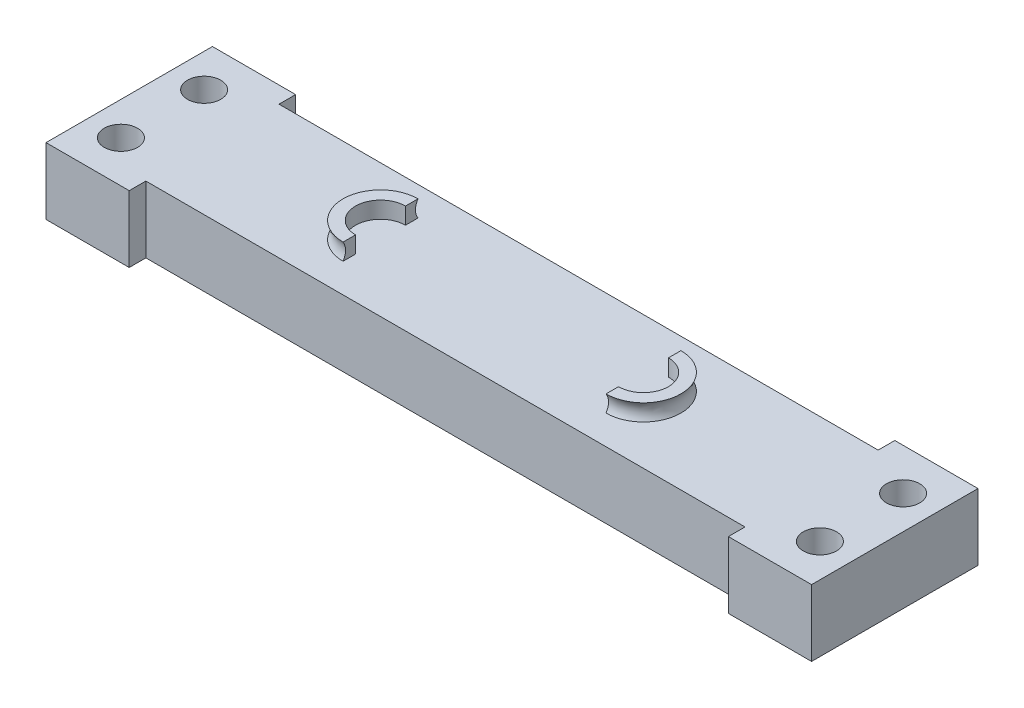
ISO-10303-21;
HEADER;
FILE_DESCRIPTION(('STEP AP214'),'2;1');
FILE_NAME('part.step','',(''),(''),'','','');
FILE_SCHEMA(('AUTOMOTIVE_DESIGN { 1 0 10303 214 1 1 1 1 }'));
ENDSEC;
DATA;
#1=APPLICATION_CONTEXT('core data for automotive mechanical design processes');
#2=APPLICATION_PROTOCOL_DEFINITION('international standard','automotive_design',2000,#1);
#3=PRODUCT_CONTEXT('',#1,'mechanical');
#4=PRODUCT('Part','Part','',(#3));
#5=PRODUCT_RELATED_PRODUCT_CATEGORY('part','',(#4));
#6=PRODUCT_DEFINITION_FORMATION('','',#4);
#7=PRODUCT_DEFINITION_CONTEXT('part definition',#1,'design');
#8=PRODUCT_DEFINITION('design','',#6,#7);
#9=PRODUCT_DEFINITION_SHAPE('','',#8);
#10=(LENGTH_UNIT() NAMED_UNIT(*) SI_UNIT(.MILLI.,.METRE.));
#11=(NAMED_UNIT(*) PLANE_ANGLE_UNIT() SI_UNIT($,.RADIAN.));
#12=(NAMED_UNIT(*) SI_UNIT($,.STERADIAN.) SOLID_ANGLE_UNIT());
#13=UNCERTAINTY_MEASURE_WITH_UNIT(LENGTH_MEASURE(1.E-05),#10,'distance_accuracy_value','');
#14=(GEOMETRIC_REPRESENTATION_CONTEXT(3) GLOBAL_UNCERTAINTY_ASSIGNED_CONTEXT((#13)) GLOBAL_UNIT_ASSIGNED_CONTEXT((#10,
#11,#12)) REPRESENTATION_CONTEXT('',''));
#15=CARTESIAN_POINT('',(0.,0.,0.));
#16=DIRECTION('',(0.,0.,1.));
#17=DIRECTION('',(1.,0.,0.));
#18=AXIS2_PLACEMENT_3D('',#15,#16,#17);
#19=CARTESIAN_POINT('',(-14.8942917357057,4.,5.5));
#20=DIRECTION('',(-1.,0.,0.));
#21=DIRECTION('',(0.,0.,1.));
#22=AXIS2_PLACEMENT_3D('',#19,#20,#21);
#23=PLANE('',#22);
#24=CARTESIAN_POINT('',(-14.8942917357056,4.,6.25000000000001));
#25=CARTESIAN_POINT('',(-14.8942917357056,4.5,5.95));
#26=CARTESIAN_POINT('',(-14.8942917357056,5.,6.25000000000001));
#27=B_SPLINE_CURVE_WITH_KNOTS('',2,(#24,#25,#26),.UNSPECIFIED.,.F.,.F.,(3,3),(0.,1.),.UNSPECIFIED.);
#28=CARTESIAN_POINT('',(-14.8942917357057,4.,6.25000000000001));
#29=VERTEX_POINT('',#28);
#30=CARTESIAN_POINT('',(-14.8942917357057,5.,6.25000000000001));
#31=VERTEX_POINT('',#30);
#32=EDGE_CURVE('E643',#29,#31,#27,.T.);
#33=ORIENTED_EDGE('',*,*,#32,.F.);
#34=DIRECTION('',(0.,0.,1.));
#35=VECTOR('',#34,1.);
#36=CARTESIAN_POINT('',(-14.8942917357057,4.,5.5));
#37=LINE('',#36,#35);
#38=CARTESIAN_POINT('',(-14.8942917357057,4.,5.5));
#39=VERTEX_POINT('',#38);
#40=EDGE_CURVE('E264',#39,#29,#37,.T.);
#41=ORIENTED_EDGE('',*,*,#40,.F.);
#42=DIRECTION('',(0.,1.,0.));
#43=VECTOR('',#42,1.);
#44=CARTESIAN_POINT('',(-14.8942917357057,4.,5.5));
#45=LINE('',#44,#43);
#46=CARTESIAN_POINT('',(-14.8942917357057,5.,5.5));
#47=VERTEX_POINT('',#46);
#48=EDGE_CURVE('E270',#39,#47,#45,.T.);
#49=ORIENTED_EDGE('',*,*,#48,.T.);
#50=DIRECTION('',(0.,0.,1.));
#51=VECTOR('',#50,1.);
#52=CARTESIAN_POINT('',(-14.8942917357057,5.,5.5));
#53=LINE('',#52,#51);
#54=EDGE_CURVE('E606',#47,#31,#53,.T.);
#55=ORIENTED_EDGE('',*,*,#54,.T.);
#56=EDGE_LOOP('',(#33,#41,#49,#55));
#57=FACE_BOUND('',#56,.T.);
#58=ADVANCED_FACE('F35',(#57),#23,.F.);
#59=CARTESIAN_POINT('',(-14.8942917357057,4.,2.5));
#60=DIRECTION('',(-1.,0.,0.));
#61=DIRECTION('',(0.,0.,1.));
#62=AXIS2_PLACEMENT_3D('',#59,#60,#61);
#63=PLANE('',#62);
#64=CARTESIAN_POINT('',(-14.8942917357057,4.,1.75000000000001));
#65=CARTESIAN_POINT('',(-14.8942917357057,4.5,2.05000000000001));
#66=CARTESIAN_POINT('',(-14.8942917357057,5.,1.75000000000001));
#67=B_SPLINE_CURVE_WITH_KNOTS('',2,(#64,#65,#66),.UNSPECIFIED.,.F.,.F.,(3,3),(0.,1.),.UNSPECIFIED.);
#68=CARTESIAN_POINT('',(-14.8942917357057,5.,1.75000000000001));
#69=VERTEX_POINT('',#68);
#70=CARTESIAN_POINT('',(-14.8942917357057,4.,1.75000000000001));
#71=VERTEX_POINT('',#70);
#72=EDGE_CURVE('E45',#69,#71,#67,.F.);
#73=ORIENTED_EDGE('',*,*,#72,.F.);
#74=DIRECTION('',(0.,0.,1.));
#75=VECTOR('',#74,1.);
#76=CARTESIAN_POINT('',(-14.8942917357057,5.,2.5));
#77=LINE('',#76,#75);
#78=CARTESIAN_POINT('',(-14.8942917357057,5.,2.5));
#79=VERTEX_POINT('',#78);
#80=EDGE_CURVE('E617',#69,#79,#77,.T.);
#81=ORIENTED_EDGE('',*,*,#80,.T.);
#82=DIRECTION('',(0.,1.,0.));
#83=VECTOR('',#82,1.);
#84=CARTESIAN_POINT('',(-14.8942917357057,4.,2.5));
#85=LINE('',#84,#83);
#86=CARTESIAN_POINT('',(-14.8942917357057,4.,2.5));
#87=VERTEX_POINT('',#86);
#88=EDGE_CURVE('E254',#87,#79,#85,.T.);
#89=ORIENTED_EDGE('',*,*,#88,.F.);
#90=DIRECTION('',(0.,0.,1.));
#91=VECTOR('',#90,1.);
#92=CARTESIAN_POINT('',(-14.8942917357057,4.,2.5));
#93=LINE('',#92,#91);
#94=EDGE_CURVE('E250',#71,#87,#93,.T.);
#95=ORIENTED_EDGE('',*,*,#94,.F.);
#96=EDGE_LOOP('',(#73,#81,#89,#95));
#97=FACE_BOUND('',#96,.T.);
#98=ADVANCED_FACE('F251',(#97),#63,.F.);
#99=CARTESIAN_POINT('',(-14.8942917357057,5.,4.00000000000001));
#100=DIRECTION('',(0.,1.,0.));
#101=DIRECTION('',(0.,0.,1.));
#102=AXIS2_PLACEMENT_3D('',#99,#100,#101);
#103=PLANE('',#102);
#104=ORIENTED_EDGE('',*,*,#54,.F.);
#105=CARTESIAN_POINT('',(-14.8942917357057,5.,4.));
#106=DIRECTION('',(0.,1.,0.));
#107=DIRECTION('',(0.,0.,-1.));
#108=AXIS2_PLACEMENT_3D('',#105,#106,#107);
#109=CIRCLE('',#108,1.5);
#110=EDGE_CURVE('E609',#79,#47,#109,.T.);
#111=ORIENTED_EDGE('',*,*,#110,.F.);
#112=ORIENTED_EDGE('',*,*,#80,.F.);
#113=CARTESIAN_POINT('',(-14.8942917357057,5.,4.00000000000001));
#114=DIRECTION('',(0.,1.,0.));
#115=DIRECTION('',(0.,0.,1.));
#116=AXIS2_PLACEMENT_3D('',#113,#114,#115);
#117=CIRCLE('',#116,2.25);
#118=EDGE_CURVE('E242',#69,#31,#117,.T.);
#119=ORIENTED_EDGE('',*,*,#118,.T.);
#120=EDGE_LOOP('',(#104,#111,#112,#119));
#121=FACE_BOUND('',#120,.T.);
#122=ADVANCED_FACE('F368',(#121),#103,.T.);
#123=CARTESIAN_POINT('',(0.,4.,0.));
#124=DIRECTION('',(0.,1.,0.));
#125=DIRECTION('',(0.,0.,1.));
#126=AXIS2_PLACEMENT_3D('',#123,#124,#125);
#127=PLANE('',#126);
#128=CARTESIAN_POINT('',(0.905708264294307,4.,4.00000000000001));
#129=DIRECTION('',(0.,1.,0.));
#130=DIRECTION('',(0.,0.,1.));
#131=AXIS2_PLACEMENT_3D('',#128,#129,#130);
#132=CIRCLE('',#131,2.25);
#133=CARTESIAN_POINT('',(0.90570826429433,4.,6.25000000000001));
#134=VERTEX_POINT('',#133);
#135=CARTESIAN_POINT('',(0.905708264294308,4.,1.75));
#136=VERTEX_POINT('',#135);
#137=EDGE_CURVE('E265',#134,#136,#132,.T.);
#138=ORIENTED_EDGE('',*,*,#137,.F.);
#139=DIRECTION('',(0.,0.,-1.));
#140=VECTOR('',#139,1.);
#141=CARTESIAN_POINT('',(0.90570826429433,4.,6.25000000000001));
#142=LINE('',#141,#140);
#143=CARTESIAN_POINT('',(0.905708264294307,4.,5.5));
#144=VERTEX_POINT('',#143);
#145=EDGE_CURVE('E624',#134,#144,#142,.T.);
#146=ORIENTED_EDGE('',*,*,#145,.T.);
#147=CARTESIAN_POINT('',(0.905708264294307,4.,4.));
#148=DIRECTION('',(0.,1.,0.));
#149=DIRECTION('',(0.,0.,1.));
#150=AXIS2_PLACEMENT_3D('',#147,#148,#149);
#151=CIRCLE('',#150,1.5);
#152=CARTESIAN_POINT('',(0.905708264294307,4.,2.5));
#153=VERTEX_POINT('',#152);
#154=EDGE_CURVE('E615',#144,#153,#151,.T.);
#155=ORIENTED_EDGE('',*,*,#154,.T.);
#156=DIRECTION('',(0.,0.,-1.));
#157=VECTOR('',#156,1.);
#158=CARTESIAN_POINT('',(0.905708264294308,4.,1.75));
#159=LINE('',#158,#157);
#160=EDGE_CURVE('E259',#153,#136,#159,.T.);
#161=ORIENTED_EDGE('',*,*,#160,.T.);
#162=EDGE_LOOP('',(#138,#146,#155,#161));
#163=FACE_BOUND('',#162,.T.);
#164=ORIENTED_EDGE('',*,*,#40,.T.);
#165=CARTESIAN_POINT('',(-14.8942917357057,4.,4.00000000000001));
#166=DIRECTION('',(0.,1.,0.));
#167=DIRECTION('',(0.,0.,1.));
#168=AXIS2_PLACEMENT_3D('',#165,#166,#167);
#169=CIRCLE('',#168,2.25);
#170=EDGE_CURVE('E238',#71,#29,#169,.T.);
#171=ORIENTED_EDGE('',*,*,#170,.F.);
#172=ORIENTED_EDGE('',*,*,#94,.T.);
#173=CARTESIAN_POINT('',(-14.8942917357057,4.,4.));
#174=DIRECTION('',(0.,1.,0.));
#175=DIRECTION('',(0.,0.,-1.));
#176=AXIS2_PLACEMENT_3D('',#173,#174,#175);
#177=CIRCLE('',#176,1.5);
#178=EDGE_CURVE('E258',#87,#39,#177,.T.);
#179=ORIENTED_EDGE('',*,*,#178,.T.);
#180=EDGE_LOOP('',(#164,#171,#172,#179));
#181=FACE_BOUND('',#180,.T.);
#182=CARTESIAN_POINT('',(14.0057082642943,4.,1.5));
#183=DIRECTION('',(0.,1.,0.));
#184=DIRECTION('',(0.,0.,1.));
#185=AXIS2_PLACEMENT_3D('',#182,#183,#184);
#186=CIRCLE('',#185,1.);
#187=CARTESIAN_POINT('',(14.0057082642943,4.,2.5));
#188=VERTEX_POINT('',#187);
#189=EDGE_CURVE('E283',#188,#188,#186,.T.);
#190=ORIENTED_EDGE('',*,*,#189,.F.);
#191=EDGE_LOOP('',(#190));
#192=FACE_BOUND('',#191,.T.);
#193=CARTESIAN_POINT('',(-27.9942917357057,4.,6.5));
#194=DIRECTION('',(0.,1.,0.));
#195=DIRECTION('',(0.,0.,1.));
#196=AXIS2_PLACEMENT_3D('',#193,#194,#195);
#197=CIRCLE('',#196,1.);
#198=CARTESIAN_POINT('',(-27.9942917357057,4.,7.50000000000001));
#199=VERTEX_POINT('',#198);
#200=EDGE_CURVE('E176',#199,#199,#197,.T.);
#201=ORIENTED_EDGE('',*,*,#200,.F.);
#202=EDGE_LOOP('',(#201));
#203=FACE_BOUND('',#202,.T.);
#204=DIRECTION('',(0.,0.,-1.));
#205=VECTOR('',#204,1.);
#206=CARTESIAN_POINT('',(-24.9942917357057,4.,-1.));
#207=LINE('',#206,#205);
#208=CARTESIAN_POINT('',(-24.9942917357057,4.,0.));
#209=VERTEX_POINT('',#208);
#210=CARTESIAN_POINT('',(-24.9942917357057,4.,-1.));
#211=VERTEX_POINT('',#210);
#212=EDGE_CURVE('E196',#209,#211,#207,.T.);
#213=ORIENTED_EDGE('',*,*,#212,.T.);
#214=DIRECTION('',(-1.,0.,0.));
#215=VECTOR('',#214,1.);
#216=CARTESIAN_POINT('',(-24.9942917357057,4.,-1.));
#217=LINE('',#216,#215);
#218=CARTESIAN_POINT('',(-29.9942917357057,4.,-0.999999999999999));
#219=VERTEX_POINT('',#218);
#220=EDGE_CURVE('E115',#211,#219,#217,.T.);
#221=ORIENTED_EDGE('',*,*,#220,.T.);
#222=DIRECTION('',(0.,0.,1.));
#223=VECTOR('',#222,1.);
#224=CARTESIAN_POINT('',(-29.9942917357057,4.,-0.999999999999999));
#225=LINE('',#224,#223);
#226=CARTESIAN_POINT('',(-29.9942917357057,4.,9.00000000000001));
#227=VERTEX_POINT('',#226);
#228=EDGE_CURVE('E301',#219,#227,#225,.T.);
#229=ORIENTED_EDGE('',*,*,#228,.T.);
#230=DIRECTION('',(1.,0.,0.));
#231=VECTOR('',#230,1.);
#232=CARTESIAN_POINT('',(-29.9942917357057,4.,9.00000000000001));
#233=LINE('',#232,#231);
#234=CARTESIAN_POINT('',(-24.9942917357057,4.,9.00000000000001));
#235=VERTEX_POINT('',#234);
#236=EDGE_CURVE('E303',#227,#235,#233,.T.);
#237=ORIENTED_EDGE('',*,*,#236,.T.);
#238=DIRECTION('',(0.,0.,-1.));
#239=VECTOR('',#238,1.);
#240=CARTESIAN_POINT('',(-24.9942917357057,4.,8.00000000000001));
#241=LINE('',#240,#239);
#242=CARTESIAN_POINT('',(-24.9942917357057,4.,8.00000000000001));
#243=VERTEX_POINT('',#242);
#244=EDGE_CURVE('E305',#235,#243,#241,.T.);
#245=ORIENTED_EDGE('',*,*,#244,.T.);
#246=DIRECTION('',(1.,0.,0.));
#247=VECTOR('',#246,1.);
#248=CARTESIAN_POINT('',(11.0057082642943,4.,8.));
#249=LINE('',#248,#247);
#250=CARTESIAN_POINT('',(11.0057082642943,4.,8.));
#251=VERTEX_POINT('',#250);
#252=EDGE_CURVE('E307',#243,#251,#249,.T.);
#253=ORIENTED_EDGE('',*,*,#252,.T.);
#254=DIRECTION('',(0.,0.,1.));
#255=VECTOR('',#254,1.);
#256=CARTESIAN_POINT('',(11.0057082642943,4.,9.));
#257=LINE('',#256,#255);
#258=CARTESIAN_POINT('',(11.0057082642943,4.,9.));
#259=VERTEX_POINT('',#258);
#260=EDGE_CURVE('E309',#251,#259,#257,.T.);
#261=ORIENTED_EDGE('',*,*,#260,.T.);
#262=DIRECTION('',(1.,0.,0.));
#263=VECTOR('',#262,1.);
#264=CARTESIAN_POINT('',(11.0057082642943,4.,9.));
#265=LINE('',#264,#263);
#266=CARTESIAN_POINT('',(16.0057082642943,4.,9.));
#267=VERTEX_POINT('',#266);
#268=EDGE_CURVE('E311',#259,#267,#265,.T.);
#269=ORIENTED_EDGE('',*,*,#268,.T.);
#270=DIRECTION('',(0.,0.,-1.));
#271=VECTOR('',#270,1.);
#272=CARTESIAN_POINT('',(16.0057082642943,4.,9.));
#273=LINE('',#272,#271);
#274=CARTESIAN_POINT('',(16.0057082642943,4.,-1.00000000000001));
#275=VERTEX_POINT('',#274);
#276=EDGE_CURVE('E151',#267,#275,#273,.T.);
#277=ORIENTED_EDGE('',*,*,#276,.T.);
#278=DIRECTION('',(-1.,0.,0.));
#279=VECTOR('',#278,1.);
#280=CARTESIAN_POINT('',(16.0057082642943,4.,-1.00000000000001));
#281=LINE('',#280,#279);
#282=CARTESIAN_POINT('',(11.0057082642943,4.,-1.));
#283=VERTEX_POINT('',#282);
#284=EDGE_CURVE('E143',#275,#283,#281,.T.);
#285=ORIENTED_EDGE('',*,*,#284,.T.);
#286=DIRECTION('',(0.,0.,1.));
#287=VECTOR('',#286,1.);
#288=CARTESIAN_POINT('',(11.0057082642943,4.,0.));
#289=LINE('',#288,#287);
#290=CARTESIAN_POINT('',(11.0057082642943,4.,0.));
#291=VERTEX_POINT('',#290);
#292=EDGE_CURVE('E148',#283,#291,#289,.T.);
#293=ORIENTED_EDGE('',*,*,#292,.T.);
#294=DIRECTION('',(-1.,0.,0.));
#295=VECTOR('',#294,1.);
#296=CARTESIAN_POINT('',(-24.9942917357057,4.,0.));
#297=LINE('',#296,#295);
#298=EDGE_CURVE('E61',#291,#209,#297,.T.);
#299=ORIENTED_EDGE('',*,*,#298,.T.);
#300=EDGE_LOOP('',(#213,#221,#229,#237,#245,#253,#261,#269,#277,#285,#293,#299));
#301=FACE_BOUND('',#300,.T.);
#302=CARTESIAN_POINT('',(-27.9942917357057,4.,1.5));
#303=DIRECTION('',(0.,1.,0.));
#304=DIRECTION('',(0.,0.,1.));
#305=AXIS2_PLACEMENT_3D('',#302,#303,#304);
#306=CIRCLE('',#305,1.);
#307=CARTESIAN_POINT('',(-27.9942917357057,4.,2.5));
#308=VERTEX_POINT('',#307);
#309=EDGE_CURVE('E289',#308,#308,#306,.T.);
#310=ORIENTED_EDGE('',*,*,#309,.F.);
#311=EDGE_LOOP('',(#310));
#312=FACE_BOUND('',#311,.T.);
#313=CARTESIAN_POINT('',(14.0057082642943,4.,6.5));
#314=DIRECTION('',(0.,1.,0.));
#315=DIRECTION('',(0.,0.,1.));
#316=AXIS2_PLACEMENT_3D('',#313,#314,#315);
#317=CIRCLE('',#316,1.);
#318=CARTESIAN_POINT('',(14.0057082642943,4.,7.50000000000001));
#319=VERTEX_POINT('',#318);
#320=EDGE_CURVE('E276',#319,#319,#317,.T.);
#321=ORIENTED_EDGE('',*,*,#320,.F.);
#322=EDGE_LOOP('',(#321));
#323=FACE_BOUND('',#322,.T.);
#324=ADVANCED_FACE('F145',(#163,#181,#192,#203,#301,#312,#323),#127,.T.);
#325=CARTESIAN_POINT('',(0.,0.,0.));
#326=DIRECTION('',(0.,1.,0.));
#327=DIRECTION('',(0.,0.,1.));
#328=AXIS2_PLACEMENT_3D('',#325,#326,#327);
#329=PLANE('',#328);
#330=CARTESIAN_POINT('',(14.0057082642943,0.,1.5));
#331=DIRECTION('',(0.,1.,0.));
#332=DIRECTION('',(0.,0.,1.));
#333=AXIS2_PLACEMENT_3D('',#330,#331,#332);
#334=CIRCLE('',#333,1.);
#335=CARTESIAN_POINT('',(14.0057082642943,0.,2.5));
#336=VERTEX_POINT('',#335);
#337=EDGE_CURVE('E279',#336,#336,#334,.T.);
#338=ORIENTED_EDGE('',*,*,#337,.T.);
#339=EDGE_LOOP('',(#338));
#340=FACE_BOUND('',#339,.T.);
#341=CARTESIAN_POINT('',(-27.9942917357057,0.,6.5));
#342=DIRECTION('',(0.,1.,0.));
#343=DIRECTION('',(0.,0.,1.));
#344=AXIS2_PLACEMENT_3D('',#341,#342,#343);
#345=CIRCLE('',#344,1.);
#346=CARTESIAN_POINT('',(-27.9942917357057,0.,7.50000000000001));
#347=VERTEX_POINT('',#346);
#348=EDGE_CURVE('E292',#347,#347,#345,.T.);
#349=ORIENTED_EDGE('',*,*,#348,.T.);
#350=EDGE_LOOP('',(#349));
#351=FACE_BOUND('',#350,.T.);
#352=DIRECTION('',(0.,0.,-1.));
#353=VECTOR('',#352,1.);
#354=CARTESIAN_POINT('',(-24.9942917357057,0.,-1.));
#355=LINE('',#354,#353);
#356=CARTESIAN_POINT('',(-24.9942917357057,0.,0.));
#357=VERTEX_POINT('',#356);
#358=CARTESIAN_POINT('',(-24.9942917357057,0.,-1.));
#359=VERTEX_POINT('',#358);
#360=EDGE_CURVE('E172',#357,#359,#355,.T.);
#361=ORIENTED_EDGE('',*,*,#360,.F.);
#362=DIRECTION('',(-1.,0.,0.));
#363=VECTOR('',#362,1.);
#364=CARTESIAN_POINT('',(-24.9942917357057,0.,0.));
#365=LINE('',#364,#363);
#366=CARTESIAN_POINT('',(11.0057082642943,0.,0.));
#367=VERTEX_POINT('',#366);
#368=EDGE_CURVE('E106',#367,#357,#365,.T.);
#369=ORIENTED_EDGE('',*,*,#368,.F.);
#370=DIRECTION('',(0.,0.,1.));
#371=VECTOR('',#370,1.);
#372=CARTESIAN_POINT('',(11.0057082642943,0.,0.));
#373=LINE('',#372,#371);
#374=CARTESIAN_POINT('',(11.0057082642943,0.,-1.));
#375=VERTEX_POINT('',#374);
#376=EDGE_CURVE('E193',#375,#367,#373,.T.);
#377=ORIENTED_EDGE('',*,*,#376,.F.);
#378=DIRECTION('',(-1.,0.,0.));
#379=VECTOR('',#378,1.);
#380=CARTESIAN_POINT('',(16.0057082642943,0.,-1.00000000000001));
#381=LINE('',#380,#379);
#382=CARTESIAN_POINT('',(16.0057082642943,0.,-1.00000000000001));
#383=VERTEX_POINT('',#382);
#384=EDGE_CURVE('E160',#383,#375,#381,.T.);
#385=ORIENTED_EDGE('',*,*,#384,.F.);
#386=DIRECTION('',(0.,0.,-1.));
#387=VECTOR('',#386,1.);
#388=CARTESIAN_POINT('',(16.0057082642943,0.,9.));
#389=LINE('',#388,#387);
#390=CARTESIAN_POINT('',(16.0057082642943,0.,9.));
#391=VERTEX_POINT('',#390);
#392=EDGE_CURVE('E190',#391,#383,#389,.T.);
#393=ORIENTED_EDGE('',*,*,#392,.F.);
#394=DIRECTION('',(1.,0.,0.));
#395=VECTOR('',#394,1.);
#396=CARTESIAN_POINT('',(11.0057082642943,0.,9.));
#397=LINE('',#396,#395);
#398=CARTESIAN_POINT('',(11.0057082642943,0.,9.));
#399=VERTEX_POINT('',#398);
#400=EDGE_CURVE('E188',#399,#391,#397,.T.);
#401=ORIENTED_EDGE('',*,*,#400,.F.);
#402=DIRECTION('',(0.,0.,1.));
#403=VECTOR('',#402,1.);
#404=CARTESIAN_POINT('',(11.0057082642943,0.,9.));
#405=LINE('',#404,#403);
#406=CARTESIAN_POINT('',(11.0057082642943,0.,8.));
#407=VERTEX_POINT('',#406);
#408=EDGE_CURVE('E186',#407,#399,#405,.T.);
#409=ORIENTED_EDGE('',*,*,#408,.F.);
#410=DIRECTION('',(1.,0.,0.));
#411=VECTOR('',#410,1.);
#412=CARTESIAN_POINT('',(11.0057082642943,0.,8.));
#413=LINE('',#412,#411);
#414=CARTESIAN_POINT('',(-24.9942917357057,0.,8.00000000000001));
#415=VERTEX_POINT('',#414);
#416=EDGE_CURVE('E184',#415,#407,#413,.T.);
#417=ORIENTED_EDGE('',*,*,#416,.F.);
#418=DIRECTION('',(0.,0.,-1.));
#419=VECTOR('',#418,1.);
#420=CARTESIAN_POINT('',(-24.9942917357057,0.,8.00000000000001));
#421=LINE('',#420,#419);
#422=CARTESIAN_POINT('',(-24.9942917357057,0.,9.00000000000001));
#423=VERTEX_POINT('',#422);
#424=EDGE_CURVE('E182',#423,#415,#421,.T.);
#425=ORIENTED_EDGE('',*,*,#424,.F.);
#426=DIRECTION('',(1.,0.,0.));
#427=VECTOR('',#426,1.);
#428=CARTESIAN_POINT('',(-29.9942917357057,0.,9.00000000000001));
#429=LINE('',#428,#427);
#430=CARTESIAN_POINT('',(-29.9942917357057,0.,9.00000000000001));
#431=VERTEX_POINT('',#430);
#432=EDGE_CURVE('E180',#431,#423,#429,.T.);
#433=ORIENTED_EDGE('',*,*,#432,.F.);
#434=DIRECTION('',(0.,0.,1.));
#435=VECTOR('',#434,1.);
#436=CARTESIAN_POINT('',(-29.9942917357057,0.,-0.999999999999999));
#437=LINE('',#436,#435);
#438=CARTESIAN_POINT('',(-29.9942917357057,0.,-0.999999999999999));
#439=VERTEX_POINT('',#438);
#440=EDGE_CURVE('E178',#439,#431,#437,.T.);
#441=ORIENTED_EDGE('',*,*,#440,.F.);
#442=DIRECTION('',(-1.,0.,0.));
#443=VECTOR('',#442,1.);
#444=CARTESIAN_POINT('',(-24.9942917357057,0.,-1.));
#445=LINE('',#444,#443);
#446=EDGE_CURVE('E175',#359,#439,#445,.T.);
#447=ORIENTED_EDGE('',*,*,#446,.F.);
#448=EDGE_LOOP('',(#361,#369,#377,#385,#393,#401,#409,#417,#425,#433,#441,#447));
#449=FACE_BOUND('',#448,.T.);
#450=CARTESIAN_POINT('',(-27.9942917357057,0.,1.5));
#451=DIRECTION('',(0.,1.,0.));
#452=DIRECTION('',(0.,0.,1.));
#453=AXIS2_PLACEMENT_3D('',#450,#451,#452);
#454=CIRCLE('',#453,1.);
#455=CARTESIAN_POINT('',(-27.9942917357057,0.,2.5));
#456=VERTEX_POINT('',#455);
#457=EDGE_CURVE('E286',#456,#456,#454,.T.);
#458=ORIENTED_EDGE('',*,*,#457,.T.);
#459=EDGE_LOOP('',(#458));
#460=FACE_BOUND('',#459,.T.);
#461=CARTESIAN_POINT('',(14.0057082642943,0.,6.5));
#462=DIRECTION('',(0.,1.,0.));
#463=DIRECTION('',(0.,0.,1.));
#464=AXIS2_PLACEMENT_3D('',#461,#462,#463);
#465=CIRCLE('',#464,1.);
#466=CARTESIAN_POINT('',(14.0057082642943,0.,7.50000000000001));
#467=VERTEX_POINT('',#466);
#468=EDGE_CURVE('E280',#467,#467,#465,.T.);
#469=ORIENTED_EDGE('',*,*,#468,.T.);
#470=EDGE_LOOP('',(#469));
#471=FACE_BOUND('',#470,.T.);
#472=ADVANCED_FACE('F324',(#340,#351,#449,#460,#471),#329,.F.);
#473=CARTESIAN_POINT('',(-24.9942917357057,4.,-1.));
#474=DIRECTION('',(-1.,0.,0.));
#475=DIRECTION('',(0.,0.,1.));
#476=AXIS2_PLACEMENT_3D('',#473,#474,#475);
#477=PLANE('',#476);
#478=ORIENTED_EDGE('',*,*,#360,.T.);
#479=DIRECTION('',(0.,-1.,0.));
#480=VECTOR('',#479,1.);
#481=CARTESIAN_POINT('',(-24.9942917357057,4.,-1.));
#482=LINE('',#481,#480);
#483=EDGE_CURVE('E221',#211,#359,#482,.T.);
#484=ORIENTED_EDGE('',*,*,#483,.F.);
#485=ORIENTED_EDGE('',*,*,#212,.F.);
#486=DIRECTION('',(0.,-1.,0.));
#487=VECTOR('',#486,1.);
#488=CARTESIAN_POINT('',(-24.9942917357057,4.,0.));
#489=LINE('',#488,#487);
#490=EDGE_CURVE('E168',#209,#357,#489,.T.);
#491=ORIENTED_EDGE('',*,*,#490,.T.);
#492=EDGE_LOOP('',(#478,#484,#485,#491));
#493=FACE_BOUND('',#492,.T.);
#494=ADVANCED_FACE('F37',(#493),#477,.F.);
#495=CARTESIAN_POINT('',(-24.9942917357057,4.,-1.));
#496=DIRECTION('',(0.,0.,1.));
#497=DIRECTION('',(1.,0.,0.));
#498=AXIS2_PLACEMENT_3D('',#495,#496,#497);
#499=PLANE('',#498);
#500=ORIENTED_EDGE('',*,*,#446,.T.);
#501=DIRECTION('',(0.,-1.,0.));
#502=VECTOR('',#501,1.);
#503=CARTESIAN_POINT('',(-29.9942917357057,4.,-0.999999999999999));
#504=LINE('',#503,#502);
#505=EDGE_CURVE('E218',#219,#439,#504,.T.);
#506=ORIENTED_EDGE('',*,*,#505,.F.);
#507=ORIENTED_EDGE('',*,*,#220,.F.);
#508=ORIENTED_EDGE('',*,*,#483,.T.);
#509=EDGE_LOOP('',(#500,#506,#507,#508));
#510=FACE_BOUND('',#509,.T.);
#511=ADVANCED_FACE('F332',(#510),#499,.F.);
#512=CARTESIAN_POINT('',(-29.9942917357057,4.,-0.999999999999999));
#513=DIRECTION('',(1.,0.,0.));
#514=DIRECTION('',(0.,0.,-1.));
#515=AXIS2_PLACEMENT_3D('',#512,#513,#514);
#516=PLANE('',#515);
#517=ORIENTED_EDGE('',*,*,#440,.T.);
#518=DIRECTION('',(0.,-1.,0.));
#519=VECTOR('',#518,1.);
#520=CARTESIAN_POINT('',(-29.9942917357057,4.,9.00000000000001));
#521=LINE('',#520,#519);
#522=EDGE_CURVE('E215',#227,#431,#521,.T.);
#523=ORIENTED_EDGE('',*,*,#522,.F.);
#524=ORIENTED_EDGE('',*,*,#228,.F.);
#525=ORIENTED_EDGE('',*,*,#505,.T.);
#526=EDGE_LOOP('',(#517,#523,#524,#525));
#527=FACE_BOUND('',#526,.T.);
#528=ADVANCED_FACE('F335',(#527),#516,.F.);
#529=CARTESIAN_POINT('',(-29.9942917357057,4.,9.00000000000001));
#530=DIRECTION('',(0.,0.,-1.));
#531=DIRECTION('',(-1.,0.,0.));
#532=AXIS2_PLACEMENT_3D('',#529,#530,#531);
#533=PLANE('',#532);
#534=ORIENTED_EDGE('',*,*,#432,.T.);
#535=DIRECTION('',(0.,-1.,0.));
#536=VECTOR('',#535,1.);
#537=CARTESIAN_POINT('',(-24.9942917357057,4.,9.00000000000001));
#538=LINE('',#537,#536);
#539=EDGE_CURVE('E212',#235,#423,#538,.T.);
#540=ORIENTED_EDGE('',*,*,#539,.F.);
#541=ORIENTED_EDGE('',*,*,#236,.F.);
#542=ORIENTED_EDGE('',*,*,#522,.T.);
#543=EDGE_LOOP('',(#534,#540,#541,#542));
#544=FACE_BOUND('',#543,.T.);
#545=ADVANCED_FACE('F340',(#544),#533,.F.);
#546=CARTESIAN_POINT('',(-24.9942917357057,4.,8.00000000000001));
#547=DIRECTION('',(-1.,0.,0.));
#548=DIRECTION('',(0.,0.,1.));
#549=AXIS2_PLACEMENT_3D('',#546,#547,#548);
#550=PLANE('',#549);
#551=ORIENTED_EDGE('',*,*,#424,.T.);
#552=DIRECTION('',(0.,-1.,0.));
#553=VECTOR('',#552,1.);
#554=CARTESIAN_POINT('',(-24.9942917357057,4.,8.00000000000001));
#555=LINE('',#554,#553);
#556=EDGE_CURVE('E209',#243,#415,#555,.T.);
#557=ORIENTED_EDGE('',*,*,#556,.F.);
#558=ORIENTED_EDGE('',*,*,#244,.F.);
#559=ORIENTED_EDGE('',*,*,#539,.T.);
#560=EDGE_LOOP('',(#551,#557,#558,#559));
#561=FACE_BOUND('',#560,.T.);
#562=ADVANCED_FACE('F346',(#561),#550,.F.);
#563=CARTESIAN_POINT('',(11.0057082642943,4.,8.));
#564=DIRECTION('',(0.,0.,-1.));
#565=DIRECTION('',(-1.,0.,0.));
#566=AXIS2_PLACEMENT_3D('',#563,#564,#565);
#567=PLANE('',#566);
#568=ORIENTED_EDGE('',*,*,#416,.T.);
#569=DIRECTION('',(0.,-1.,0.));
#570=VECTOR('',#569,1.);
#571=CARTESIAN_POINT('',(11.0057082642943,4.,8.));
#572=LINE('',#571,#570);
#573=EDGE_CURVE('E206',#251,#407,#572,.T.);
#574=ORIENTED_EDGE('',*,*,#573,.F.);
#575=ORIENTED_EDGE('',*,*,#252,.F.);
#576=ORIENTED_EDGE('',*,*,#556,.T.);
#577=EDGE_LOOP('',(#568,#574,#575,#576));
#578=FACE_BOUND('',#577,.T.);
#579=ADVANCED_FACE('F350',(#578),#567,.F.);
#580=CARTESIAN_POINT('',(11.0057082642943,4.,9.));
#581=DIRECTION('',(1.,0.,0.));
#582=DIRECTION('',(0.,0.,-1.));
#583=AXIS2_PLACEMENT_3D('',#580,#581,#582);
#584=PLANE('',#583);
#585=ORIENTED_EDGE('',*,*,#408,.T.);
#586=DIRECTION('',(0.,-1.,0.));
#587=VECTOR('',#586,1.);
#588=CARTESIAN_POINT('',(11.0057082642943,4.,9.));
#589=LINE('',#588,#587);
#590=EDGE_CURVE('E203',#259,#399,#589,.T.);
#591=ORIENTED_EDGE('',*,*,#590,.F.);
#592=ORIENTED_EDGE('',*,*,#260,.F.);
#593=ORIENTED_EDGE('',*,*,#573,.T.);
#594=EDGE_LOOP('',(#585,#591,#592,#593));
#595=FACE_BOUND('',#594,.T.);
#596=ADVANCED_FACE('F353',(#595),#584,.F.);
#597=CARTESIAN_POINT('',(11.0057082642943,4.,9.));
#598=DIRECTION('',(0.,0.,-1.));
#599=DIRECTION('',(-1.,0.,0.));
#600=AXIS2_PLACEMENT_3D('',#597,#598,#599);
#601=PLANE('',#600);
#602=ORIENTED_EDGE('',*,*,#400,.T.);
#603=DIRECTION('',(0.,-1.,0.));
#604=VECTOR('',#603,1.);
#605=CARTESIAN_POINT('',(16.0057082642943,4.,9.));
#606=LINE('',#605,#604);
#607=EDGE_CURVE('E200',#267,#391,#606,.T.);
#608=ORIENTED_EDGE('',*,*,#607,.F.);
#609=ORIENTED_EDGE('',*,*,#268,.F.);
#610=ORIENTED_EDGE('',*,*,#590,.T.);
#611=EDGE_LOOP('',(#602,#608,#609,#610));
#612=FACE_BOUND('',#611,.T.);
#613=ADVANCED_FACE('F317',(#612),#601,.F.);
#614=CARTESIAN_POINT('',(16.0057082642943,4.,9.));
#615=DIRECTION('',(-1.,0.,0.));
#616=DIRECTION('',(0.,0.,1.));
#617=AXIS2_PLACEMENT_3D('',#614,#615,#616);
#618=PLANE('',#617);
#619=ORIENTED_EDGE('',*,*,#392,.T.);
#620=DIRECTION('',(0.,-1.,0.));
#621=VECTOR('',#620,1.);
#622=CARTESIAN_POINT('',(16.0057082642943,4.,-1.00000000000001));
#623=LINE('',#622,#621);
#624=EDGE_CURVE('E163',#275,#383,#623,.T.);
#625=ORIENTED_EDGE('',*,*,#624,.F.);
#626=ORIENTED_EDGE('',*,*,#276,.F.);
#627=ORIENTED_EDGE('',*,*,#607,.T.);
#628=EDGE_LOOP('',(#619,#625,#626,#627));
#629=FACE_BOUND('',#628,.T.);
#630=ADVANCED_FACE('F321',(#629),#618,.F.);
#631=CARTESIAN_POINT('',(16.0057082642943,4.,-1.00000000000001));
#632=DIRECTION('',(0.,0.,1.));
#633=DIRECTION('',(1.,0.,0.));
#634=AXIS2_PLACEMENT_3D('',#631,#632,#633);
#635=PLANE('',#634);
#636=ORIENTED_EDGE('',*,*,#384,.T.);
#637=DIRECTION('',(0.,-1.,0.));
#638=VECTOR('',#637,1.);
#639=CARTESIAN_POINT('',(11.0057082642943,4.,-1.));
#640=LINE('',#639,#638);
#641=EDGE_CURVE('E157',#283,#375,#640,.T.);
#642=ORIENTED_EDGE('',*,*,#641,.F.);
#643=ORIENTED_EDGE('',*,*,#284,.F.);
#644=ORIENTED_EDGE('',*,*,#624,.T.);
#645=EDGE_LOOP('',(#636,#642,#643,#644));
#646=FACE_BOUND('',#645,.T.);
#647=ADVANCED_FACE('F158',(#646),#635,.F.);
#648=CARTESIAN_POINT('',(11.0057082642943,4.,0.));
#649=DIRECTION('',(1.,0.,0.));
#650=DIRECTION('',(0.,0.,-1.));
#651=AXIS2_PLACEMENT_3D('',#648,#649,#650);
#652=PLANE('',#651);
#653=ORIENTED_EDGE('',*,*,#376,.T.);
#654=DIRECTION('',(0.,-1.,0.));
#655=VECTOR('',#654,1.);
#656=CARTESIAN_POINT('',(11.0057082642943,4.,0.));
#657=LINE('',#656,#655);
#658=EDGE_CURVE('E164',#291,#367,#657,.T.);
#659=ORIENTED_EDGE('',*,*,#658,.F.);
#660=ORIENTED_EDGE('',*,*,#292,.F.);
#661=ORIENTED_EDGE('',*,*,#641,.T.);
#662=EDGE_LOOP('',(#653,#659,#660,#661));
#663=FACE_BOUND('',#662,.T.);
#664=ADVANCED_FACE('F166',(#663),#652,.F.);
#665=CARTESIAN_POINT('',(-24.9942917357057,4.,0.));
#666=DIRECTION('',(0.,0.,1.));
#667=DIRECTION('',(1.,0.,0.));
#668=AXIS2_PLACEMENT_3D('',#665,#666,#667);
#669=PLANE('',#668);
#670=ORIENTED_EDGE('',*,*,#368,.T.);
#671=ORIENTED_EDGE('',*,*,#490,.F.);
#672=ORIENTED_EDGE('',*,*,#298,.F.);
#673=ORIENTED_EDGE('',*,*,#658,.T.);
#674=EDGE_LOOP('',(#670,#671,#672,#673));
#675=FACE_BOUND('',#674,.T.);
#676=ADVANCED_FACE('F326',(#675),#669,.F.);
#677=CARTESIAN_POINT('',(-27.9942917357057,4.,6.5));
#678=DIRECTION('',(0.,-1.,0.));
#679=DIRECTION('',(0.,0.,-1.));
#680=AXIS2_PLACEMENT_3D('',#677,#678,#679);
#681=CYLINDRICAL_SURFACE('',#680,1.);
#682=ORIENTED_EDGE('',*,*,#200,.T.);
#683=EDGE_LOOP('',(#682));
#684=FACE_BOUND('',#683,.T.);
#685=ORIENTED_EDGE('',*,*,#348,.F.);
#686=EDGE_LOOP('',(#685));
#687=FACE_BOUND('',#686,.T.);
#688=ADVANCED_FACE('F400',(#684,#687),#681,.F.);
#689=CARTESIAN_POINT('',(-27.9942917357057,4.,1.5));
#690=DIRECTION('',(0.,-1.,0.));
#691=DIRECTION('',(0.,0.,-1.));
#692=AXIS2_PLACEMENT_3D('',#689,#690,#691);
#693=CYLINDRICAL_SURFACE('',#692,1.);
#694=ORIENTED_EDGE('',*,*,#309,.T.);
#695=EDGE_LOOP('',(#694));
#696=FACE_BOUND('',#695,.T.);
#697=ORIENTED_EDGE('',*,*,#457,.F.);
#698=EDGE_LOOP('',(#697));
#699=FACE_BOUND('',#698,.T.);
#700=ADVANCED_FACE('F396',(#696,#699),#693,.F.);
#701=CARTESIAN_POINT('',(14.0057082642943,4.,1.5));
#702=DIRECTION('',(0.,-1.,0.));
#703=DIRECTION('',(0.,0.,-1.));
#704=AXIS2_PLACEMENT_3D('',#701,#702,#703);
#705=CYLINDRICAL_SURFACE('',#704,1.);
#706=ORIENTED_EDGE('',*,*,#189,.T.);
#707=EDGE_LOOP('',(#706));
#708=FACE_BOUND('',#707,.T.);
#709=ORIENTED_EDGE('',*,*,#337,.F.);
#710=EDGE_LOOP('',(#709));
#711=FACE_BOUND('',#710,.T.);
#712=ADVANCED_FACE('F392',(#708,#711),#705,.F.);
#713=CARTESIAN_POINT('',(14.0057082642943,4.,6.5));
#714=DIRECTION('',(0.,-1.,0.));
#715=DIRECTION('',(0.,0.,-1.));
#716=AXIS2_PLACEMENT_3D('',#713,#714,#715);
#717=CYLINDRICAL_SURFACE('',#716,1.);
#718=ORIENTED_EDGE('',*,*,#320,.T.);
#719=EDGE_LOOP('',(#718));
#720=FACE_BOUND('',#719,.T.);
#721=ORIENTED_EDGE('',*,*,#468,.F.);
#722=EDGE_LOOP('',(#721));
#723=FACE_BOUND('',#722,.T.);
#724=ADVANCED_FACE('F388',(#720,#723),#717,.F.);
#725=DIRECTION('',(0.,0.,-1.));
#726=VECTOR('',#725,1.);
#727=CARTESIAN_POINT('',(0.90570826429433,5.,6.25000000000001));
#728=LINE('',#727,#726);
#729=CARTESIAN_POINT('',(0.90570826429433,5.,6.25000000000001));
#730=VERTEX_POINT('',#729);
#731=CARTESIAN_POINT('',(0.905708264294307,5.,5.5));
#732=VERTEX_POINT('',#731);
#733=EDGE_CURVE('E612',#730,#732,#728,.T.);
#734=ORIENTED_EDGE('',*,*,#733,.F.);
#735=CARTESIAN_POINT('',(0.905708264294307,5.,4.00000000000001));
#736=DIRECTION('',(0.,1.,0.));
#737=DIRECTION('',(0.,0.,1.));
#738=AXIS2_PLACEMENT_3D('',#735,#736,#737);
#739=CIRCLE('',#738,2.25);
#740=CARTESIAN_POINT('',(0.905708264294307,5.,1.75));
#741=VERTEX_POINT('',#740);
#742=EDGE_CURVE('E273',#730,#741,#739,.T.);
#743=ORIENTED_EDGE('',*,*,#742,.T.);
#744=DIRECTION('',(0.,0.,-1.));
#745=VECTOR('',#744,1.);
#746=CARTESIAN_POINT('',(0.905708264294308,5.,1.75));
#747=LINE('',#746,#745);
#748=CARTESIAN_POINT('',(0.905708264294305,5.,2.5));
#749=VERTEX_POINT('',#748);
#750=EDGE_CURVE('E631',#749,#741,#747,.T.);
#751=ORIENTED_EDGE('',*,*,#750,.F.);
#752=CARTESIAN_POINT('',(0.905708264294307,5.,4.));
#753=DIRECTION('',(0.,1.,0.));
#754=DIRECTION('',(0.,0.,1.));
#755=AXIS2_PLACEMENT_3D('',#752,#753,#754);
#756=CIRCLE('',#755,1.5);
#757=EDGE_CURVE('E52',#732,#749,#756,.T.);
#758=ORIENTED_EDGE('',*,*,#757,.F.);
#759=EDGE_LOOP('',(#734,#743,#751,#758));
#760=FACE_BOUND('',#759,.T.);
#761=ADVANCED_FACE('F385',(#760),#103,.T.);
#762=CARTESIAN_POINT('',(0.905708264294307,4.,4.));
#763=DIRECTION('',(0.,1.,0.));
#764=DIRECTION('',(0.,0.,1.));
#765=AXIS2_PLACEMENT_3D('',#762,#763,#764);
#766=CYLINDRICAL_SURFACE('',#765,1.5);
#767=ORIENTED_EDGE('',*,*,#757,.T.);
#768=DIRECTION('',(0.,1.,0.));
#769=VECTOR('',#768,1.);
#770=CARTESIAN_POINT('',(0.905708264294307,4.,2.5));
#771=LINE('',#770,#769);
#772=EDGE_CURVE('E623',#153,#749,#771,.T.);
#773=ORIENTED_EDGE('',*,*,#772,.F.);
#774=ORIENTED_EDGE('',*,*,#154,.F.);
#775=DIRECTION('',(0.,1.,0.));
#776=VECTOR('',#775,1.);
#777=CARTESIAN_POINT('',(0.905708264294307,4.,5.5));
#778=LINE('',#777,#776);
#779=EDGE_CURVE('E266',#144,#732,#778,.T.);
#780=ORIENTED_EDGE('',*,*,#779,.T.);
#781=EDGE_LOOP('',(#767,#773,#774,#780));
#782=FACE_BOUND('',#781,.T.);
#783=ADVANCED_FACE('F382',(#782),#766,.F.);
#784=CARTESIAN_POINT('',(0.90570826429433,4.,6.25000000000001));
#785=DIRECTION('',(1.,0.,0.));
#786=DIRECTION('',(0.,0.,-1.));
#787=AXIS2_PLACEMENT_3D('',#784,#785,#786);
#788=PLANE('',#787);
#789=ORIENTED_EDGE('',*,*,#145,.F.);
#790=CARTESIAN_POINT('',(0.905708264294378,5.,6.25000000000001));
#791=CARTESIAN_POINT('',(0.905708264294363,4.5,5.95));
#792=CARTESIAN_POINT('',(0.905708264294378,4.,6.25000000000001));
#793=B_SPLINE_CURVE_WITH_KNOTS('',2,(#790,#791,#792),.UNSPECIFIED.,.F.,.F.,(3,3),(0.,1.),.UNSPECIFIED.);
#794=EDGE_CURVE('E637',#134,#730,#793,.F.);
#795=ORIENTED_EDGE('',*,*,#794,.T.);
#796=ORIENTED_EDGE('',*,*,#733,.T.);
#797=ORIENTED_EDGE('',*,*,#779,.F.);
#798=EDGE_LOOP('',(#789,#795,#796,#797));
#799=FACE_BOUND('',#798,.T.);
#800=ADVANCED_FACE('F372',(#799),#788,.F.);
#801=CARTESIAN_POINT('',(-14.8942917357057,4.,4.));
#802=DIRECTION('',(0.,1.,0.));
#803=DIRECTION('',(0.,0.,1.));
#804=AXIS2_PLACEMENT_3D('',#801,#802,#803);
#805=CYLINDRICAL_SURFACE('',#804,1.5);
#806=ORIENTED_EDGE('',*,*,#110,.T.);
#807=ORIENTED_EDGE('',*,*,#48,.F.);
#808=ORIENTED_EDGE('',*,*,#178,.F.);
#809=ORIENTED_EDGE('',*,*,#88,.T.);
#810=EDGE_LOOP('',(#806,#807,#808,#809));
#811=FACE_BOUND('',#810,.T.);
#812=ADVANCED_FACE('F374',(#811),#805,.F.);
#813=CARTESIAN_POINT('',(0.905708264294308,4.,1.75));
#814=DIRECTION('',(1.,0.,0.));
#815=DIRECTION('',(0.,0.,-1.));
#816=AXIS2_PLACEMENT_3D('',#813,#814,#815);
#817=PLANE('',#816);
#818=ORIENTED_EDGE('',*,*,#750,.T.);
#819=CARTESIAN_POINT('',(0.905708264294309,5.,1.75));
#820=CARTESIAN_POINT('',(0.905708264294315,4.5,2.05000000000001));
#821=CARTESIAN_POINT('',(0.905708264294309,4.,1.75));
#822=B_SPLINE_CURVE_WITH_KNOTS('',2,(#819,#820,#821),.UNSPECIFIED.,.F.,.F.,(3,3),(0.,1.),.UNSPECIFIED.);
#823=EDGE_CURVE('E11',#741,#136,#822,.T.);
#824=ORIENTED_EDGE('',*,*,#823,.T.);
#825=ORIENTED_EDGE('',*,*,#160,.F.);
#826=ORIENTED_EDGE('',*,*,#772,.T.);
#827=EDGE_LOOP('',(#818,#824,#825,#826));
#828=FACE_BOUND('',#827,.T.);
#829=ADVANCED_FACE('F376',(#828),#817,.F.);
#830=CARTESIAN_POINT('',(-14.8942917357057,4.,6.25000000000001));
#831=CARTESIAN_POINT('',(-14.8942917357057,4.5,5.95));
#832=CARTESIAN_POINT('',(-14.8942917357057,5.,6.25000000000001));
#833=B_SPLINE_CURVE_WITH_KNOTS('',2,(#830,#831,#832),.UNSPECIFIED.,.F.,.F.,(3,3),(0.,1.),.UNSPECIFIED.);
#834=CARTESIAN_POINT('',(-14.8942917357057,5.,4.00000000000001));
#835=DIRECTION('',(0.,-1.,0.));
#836=AXIS1_PLACEMENT('',#834,#835);
#837=SURFACE_OF_REVOLUTION('',#833,#836);
#838=ORIENTED_EDGE('',*,*,#32,.T.);
#839=ORIENTED_EDGE('',*,*,#118,.F.);
#840=ORIENTED_EDGE('',*,*,#72,.T.);
#841=ORIENTED_EDGE('',*,*,#170,.T.);
#842=EDGE_LOOP('',(#838,#839,#840,#841));
#843=FACE_BOUND('',#842,.T.);
#844=ADVANCED_FACE('F235',(#843),#837,.F.);
#845=CARTESIAN_POINT('',(0.90570826429433,5.,6.25000000000001));
#846=CARTESIAN_POINT('',(0.905708264294321,4.5,5.95));
#847=CARTESIAN_POINT('',(0.90570826429433,4.,6.25000000000001));
#848=B_SPLINE_CURVE_WITH_KNOTS('',2,(#845,#846,#847),.UNSPECIFIED.,.F.,.F.,(3,3),(0.,1.),.UNSPECIFIED.);
#849=CARTESIAN_POINT('',(0.905708264294307,5.,4.00000000000001));
#850=DIRECTION('',(0.,-1.,0.));
#851=AXIS1_PLACEMENT('',#849,#850);
#852=SURFACE_OF_REVOLUTION('',#848,#851);
#853=ORIENTED_EDGE('',*,*,#137,.T.);
#854=ORIENTED_EDGE('',*,*,#823,.F.);
#855=ORIENTED_EDGE('',*,*,#742,.F.);
#856=ORIENTED_EDGE('',*,*,#794,.F.);
#857=EDGE_LOOP('',(#853,#854,#855,#856));
#858=FACE_BOUND('',#857,.T.);
#859=ADVANCED_FACE('F480',(#858),#852,.T.);
#860=CLOSED_SHELL('',(#58,#98,#122,#324,#472,#494,#511,#528,#545,#562,#579,#596,#613,#630,#647,
#664,#676,#688,#700,#712,#724,#761,#783,#800,#812,#829,#844,#859));
#861=MANIFOLD_SOLID_BREP('B2',#860);
#862=ADVANCED_BREP_SHAPE_REPRESENTATION('',(#18,#861),#14);
#863=SHAPE_DEFINITION_REPRESENTATION(#9,#862);
ENDSEC;
END-ISO-10303-21;
